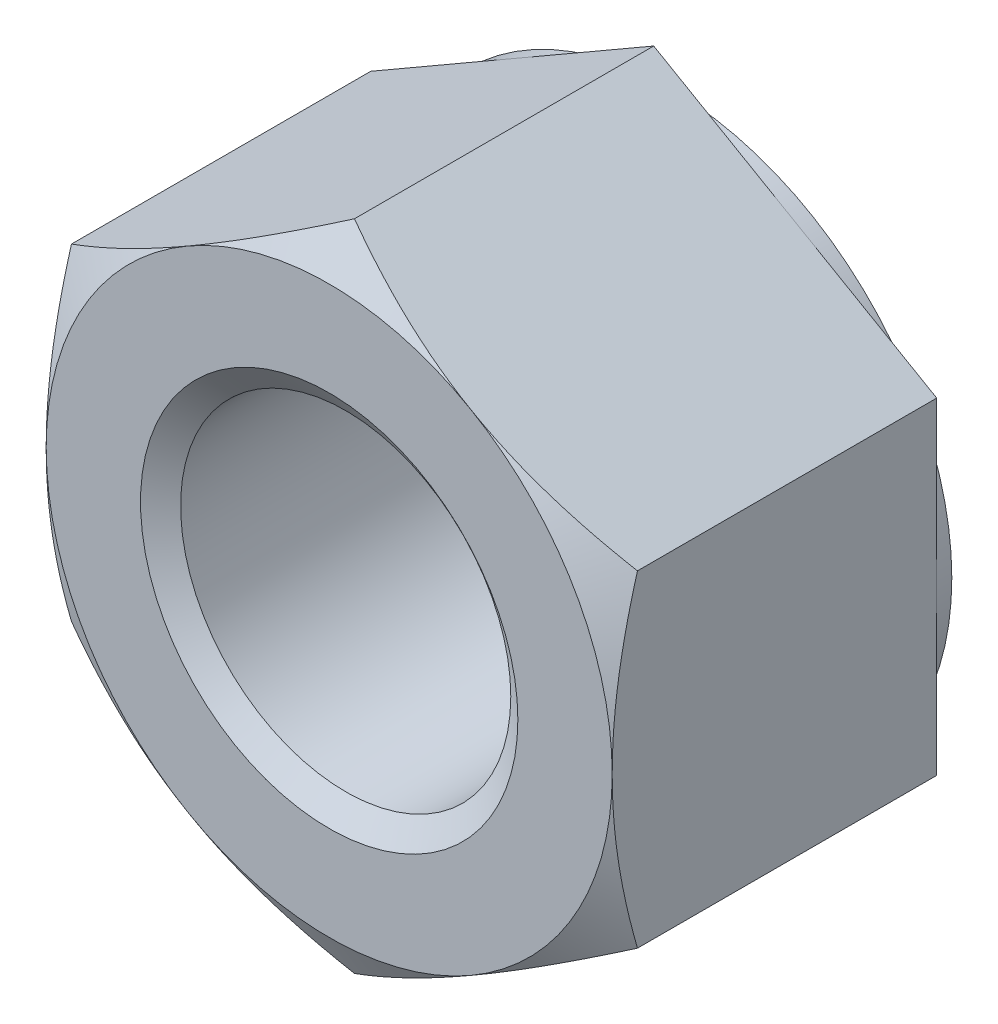
ISO-10303-21;
HEADER;
FILE_DESCRIPTION(('STEP AP214'),'2;1');
FILE_NAME('part.step','',(''),(''),'','','');
FILE_SCHEMA(('AUTOMOTIVE_DESIGN { 1 0 10303 214 1 1 1 1 }'));
ENDSEC;
DATA;
#1=APPLICATION_CONTEXT('core data for automotive mechanical design processes');
#2=APPLICATION_PROTOCOL_DEFINITION('international standard','automotive_design',2000,#1);
#3=PRODUCT_CONTEXT('',#1,'mechanical');
#4=PRODUCT('Part','Part','',(#3));
#5=PRODUCT_RELATED_PRODUCT_CATEGORY('part','',(#4));
#6=PRODUCT_DEFINITION_FORMATION('','',#4);
#7=PRODUCT_DEFINITION_CONTEXT('part definition',#1,'design');
#8=PRODUCT_DEFINITION('design','',#6,#7);
#9=PRODUCT_DEFINITION_SHAPE('','',#8);
#10=(LENGTH_UNIT() NAMED_UNIT(*) SI_UNIT(.MILLI.,.METRE.));
#11=(NAMED_UNIT(*) PLANE_ANGLE_UNIT() SI_UNIT($,.RADIAN.));
#12=(NAMED_UNIT(*) SI_UNIT($,.STERADIAN.) SOLID_ANGLE_UNIT());
#13=UNCERTAINTY_MEASURE_WITH_UNIT(LENGTH_MEASURE(1.E-05),#10,'distance_accuracy_value','');
#14=(GEOMETRIC_REPRESENTATION_CONTEXT(3) GLOBAL_UNCERTAINTY_ASSIGNED_CONTEXT((#13)) GLOBAL_UNIT_ASSIGNED_CONTEXT((#10,
#11,#12)) REPRESENTATION_CONTEXT('',''));
#15=CARTESIAN_POINT('',(0.,0.,0.));
#16=DIRECTION('',(0.,0.,1.));
#17=DIRECTION('',(1.,0.,0.));
#18=AXIS2_PLACEMENT_3D('',#15,#16,#17);
#19=CARTESIAN_POINT('',(0.,0.,-18.));
#20=DIRECTION('',(0.,0.,1.));
#21=DIRECTION('',(1.,0.,0.));
#22=AXIS2_PLACEMENT_3D('',#19,#20,#21);
#23=CYLINDRICAL_SURFACE('',#22,8.75);
#24=CARTESIAN_POINT('',(0.,0.,-0.875259422762141));
#25=DIRECTION('',(0.,0.,1.));
#26=DIRECTION('',(1.,0.,0.));
#27=AXIS2_PLACEMENT_3D('',#24,#25,#26);
#28=CIRCLE('',#27,8.75);
#29=CARTESIAN_POINT('',(8.75,0.,-0.875259422762141));
#30=VERTEX_POINT('',#29);
#31=EDGE_CURVE('E152',#30,#30,#28,.F.);
#32=ORIENTED_EDGE('',*,*,#31,.F.);
#33=EDGE_LOOP('',(#32));
#34=FACE_BOUND('',#33,.T.);
#35=CARTESIAN_POINT('',(0.,0.,-17.0993405772379));
#36=DIRECTION('',(0.,0.,-1.));
#37=DIRECTION('',(-1.,0.,0.));
#38=AXIS2_PLACEMENT_3D('',#35,#36,#37);
#39=CIRCLE('',#38,8.75);
#40=CARTESIAN_POINT('',(-8.75,0.,-17.0993405772379));
#41=VERTEX_POINT('',#40);
#42=EDGE_CURVE('E40',#41,#41,#39,.F.);
#43=ORIENTED_EDGE('',*,*,#42,.F.);
#44=EDGE_LOOP('',(#43));
#45=FACE_BOUND('',#44,.T.);
#46=ADVANCED_FACE('F35',(#34,#45),#23,.F.);
#47=CARTESIAN_POINT('',(-30.,0.,-18.));
#48=DIRECTION('',(0.,0.,1.));
#49=DIRECTION('',(1.,0.,0.));
#50=AXIS2_PLACEMENT_3D('',#47,#48,#49);
#51=PLANE('',#50);
#52=CARTESIAN_POINT('',(0.,0.,-18.));
#53=DIRECTION('',(0.,0.,1.));
#54=DIRECTION('',(1.,0.,0.));
#55=AXIS2_PLACEMENT_3D('',#52,#53,#54);
#56=CIRCLE('',#55,15.);
#57=CARTESIAN_POINT('',(15.,0.,-18.));
#58=VERTEX_POINT('',#57);
#59=EDGE_CURVE('E276',#58,#58,#56,.F.);
#60=ORIENTED_EDGE('',*,*,#59,.T.);
#61=EDGE_LOOP('',(#60));
#62=FACE_BOUND('',#61,.T.);
#63=CARTESIAN_POINT('',(0.,0.,-18.));
#64=DIRECTION('',(0.,0.,1.));
#65=DIRECTION('',(1.,0.,0.));
#66=AXIS2_PLACEMENT_3D('',#63,#64,#65);
#67=CIRCLE('',#66,10.);
#68=CARTESIAN_POINT('',(10.,0.,-18.));
#69=VERTEX_POINT('',#68);
#70=EDGE_CURVE('E296',#69,#69,#67,.F.);
#71=ORIENTED_EDGE('',*,*,#70,.F.);
#72=EDGE_LOOP('',(#71));
#73=FACE_BOUND('',#72,.T.);
#74=ADVANCED_FACE('F228',(#62,#73),#51,.F.);
#75=CARTESIAN_POINT('',(-30.,0.,0.));
#76=DIRECTION('',(0.,0.,1.));
#77=DIRECTION('',(1.,0.,0.));
#78=AXIS2_PLACEMENT_3D('',#75,#76,#77);
#79=PLANE('',#78);
#80=CARTESIAN_POINT('',(0.,0.,0.));
#81=DIRECTION('',(0.,0.,1.));
#82=DIRECTION('',(1.,0.,0.));
#83=AXIS2_PLACEMENT_3D('',#80,#81,#82);
#84=CIRCLE('',#83,15.);
#85=CARTESIAN_POINT('',(15.,0.,0.));
#86=VERTEX_POINT('',#85);
#87=CARTESIAN_POINT('',(7.50000000000002,-12.9903810567666,0.));
#88=VERTEX_POINT('',#87);
#89=EDGE_CURVE('E12',#86,#88,#84,.F.);
#90=ORIENTED_EDGE('',*,*,#89,.F.);
#91=CARTESIAN_POINT('',(0.,0.,0.));
#92=DIRECTION('',(0.,0.,1.));
#93=DIRECTION('',(1.,0.,0.));
#94=AXIS2_PLACEMENT_3D('',#91,#92,#93);
#95=CIRCLE('',#94,15.);
#96=CARTESIAN_POINT('',(7.50000000000002,12.9903810567666,0.));
#97=VERTEX_POINT('',#96);
#98=EDGE_CURVE('E144',#86,#97,#95,.T.);
#99=ORIENTED_EDGE('',*,*,#98,.T.);
#100=CARTESIAN_POINT('',(-7.50000000000002,12.9903810567666,0.));
#101=VERTEX_POINT('',#100);
#102=EDGE_CURVE('E47',#101,#97,#84,.F.);
#103=ORIENTED_EDGE('',*,*,#102,.F.);
#104=CARTESIAN_POINT('',(-15.,0.,0.));
#105=VERTEX_POINT('',#104);
#106=EDGE_CURVE('E357',#105,#101,#84,.F.);
#107=ORIENTED_EDGE('',*,*,#106,.F.);
#108=CARTESIAN_POINT('',(-7.50000000000002,-12.9903810567666,0.));
#109=VERTEX_POINT('',#108);
#110=EDGE_CURVE('E359',#109,#105,#84,.F.);
#111=ORIENTED_EDGE('',*,*,#110,.F.);
#112=EDGE_CURVE('E45',#88,#109,#84,.F.);
#113=ORIENTED_EDGE('',*,*,#112,.F.);
#114=EDGE_LOOP('',(#90,#99,#103,#107,#111,#113));
#115=FACE_BOUND('',#114,.T.);
#116=CARTESIAN_POINT('',(0.,0.,0.));
#117=DIRECTION('',(0.,0.,1.));
#118=DIRECTION('',(1.,0.,0.));
#119=AXIS2_PLACEMENT_3D('',#116,#117,#118);
#120=CIRCLE('',#119,10.);
#121=CARTESIAN_POINT('',(10.,0.,0.));
#122=VERTEX_POINT('',#121);
#123=EDGE_CURVE('E295',#122,#122,#120,.T.);
#124=ORIENTED_EDGE('',*,*,#123,.F.);
#125=EDGE_LOOP('',(#124));
#126=FACE_BOUND('',#125,.T.);
#127=ADVANCED_FACE('F154',(#115,#126),#79,.T.);
#128=CARTESIAN_POINT('',(0.,17.3205080756888,-18.));
#129=DIRECTION('',(-0.500000000000001,0.866025403784438,0.));
#130=DIRECTION('',(-0.866025403784438,-0.500000000000001,0.));
#131=AXIS2_PLACEMENT_3D('',#128,#129,#130);
#132=PLANE('',#131);
#133=DIRECTION('',(0.,0.,1.));
#134=VECTOR('',#133,1.);
#135=CARTESIAN_POINT('',(-15.,8.66025403784437,-18.));
#136=LINE('',#135,#134);
#137=CARTESIAN_POINT('',(-15.,8.66025403784437,-17.2));
#138=VERTEX_POINT('',#137);
#139=CARTESIAN_POINT('',(-15.,8.66025403784437,-1.33974596215562));
#140=VERTEX_POINT('',#139);
#141=EDGE_CURVE('E285',#138,#140,#136,.T.);
#142=ORIENTED_EDGE('',*,*,#141,.T.);
#143=CARTESIAN_POINT('',(-15.0002,8.66013856779054,-1.33981262948894));
#144=CARTESIAN_POINT('',(-14.6705058957662,8.85048754762015,-1.22992178974394));
#145=CARTESIAN_POINT('',(-14.3395258073717,9.04157899075113,-1.12501758932861));
#146=CARTESIAN_POINT('',(-13.674911559644,9.42529420558398,-0.926568581943102));
#147=CARTESIAN_POINT('',(-13.3412765656162,9.61791845919701,-0.833027511049492));
#148=CARTESIAN_POINT('',(-12.6707077197453,10.0050715628708,-0.658562147609859));
#149=CARTESIAN_POINT('',(-12.333767999973,10.199603800782,-0.577667706602186));
#150=CARTESIAN_POINT('',(-11.6575472373606,10.5900200401078,-0.430232643422043));
#151=CARTESIAN_POINT('',(-11.3182663292305,10.7859039637477,-0.363691202381326));
#152=CARTESIAN_POINT('',(-10.6460568576327,11.1740042831265,-0.247792374696308));
#153=CARTESIAN_POINT('',(-10.3131781995737,11.3661918659643,-0.198051383436665));
#154=CARTESIAN_POINT('',(-9.64589556983831,11.7514476718676,-0.114646749003606));
#155=CARTESIAN_POINT('',(-9.31149156892751,11.9445159118115,-0.0809834152900859));
#156=CARTESIAN_POINT('',(-8.64212181582285,12.3309767189539,-0.0305840757080833));
#157=CARTESIAN_POINT('',(-8.30715720719665,12.5243686259132,-0.0138279549580483));
#158=CARTESIAN_POINT('',(-7.636918786609,12.9113309584608,0.00239660617302434));
#159=CARTESIAN_POINT('',(-7.30164498452176,13.1049013783481,0.0018655807275811));
#160=CARTESIAN_POINT('',(-6.6748531126878,13.4667798342773,-0.0152766129981669));
#161=CARTESIAN_POINT('',(-6.38329037496757,13.6351136593857,-0.0297968460490132));
#162=CARTESIAN_POINT('',(-5.80083556199352,13.9713941024471,-0.0716371404224109));
#163=CARTESIAN_POINT('',(-5.50994353564011,14.1393406921673,-0.0989581071094768));
#164=CARTESIAN_POINT('',(-4.92898814775338,14.4747554417509,-0.165923511998906));
#165=CARTESIAN_POINT('',(-4.63892567103482,14.6422230907662,-0.205578128270663));
#166=CARTESIAN_POINT('',(-4.06016058267397,14.9763732703289,-0.296515103017905));
#167=CARTESIAN_POINT('',(-3.77145806484047,15.1430557467157,-0.347798251969261));
#168=CARTESIAN_POINT('',(-2.89508556123959,15.6490296475801,-0.520386864747112));
#169=CARTESIAN_POINT('',(-2.30995340076274,15.9868558579429,-0.658901178256936));
#170=CARTESIAN_POINT('',(-1.14841408999664,16.6574708916881,-0.973271968475219));
#171=CARTESIAN_POINT('',(-0.571992068234585,16.9902683011192,-1.14905461461788));
#172=CARTESIAN_POINT('',(0.000200000000000169,17.3206235457426,-1.33981262948895));
#173=B_SPLINE_CURVE_WITH_KNOTS('',3,(#143,#144,#145,#146,#147,#148,#149,#150,#151,#152,#153,
#154,#155,#156,#157,#158,#159,#160,#161,#162,#163,#164,#165,#166,#167,#168,#169,#170,#171,#172),
.UNSPECIFIED.,.F.,.F.,(4,2,2,2,2,2,2,2,2,2,2,2,2,2,4),(0.,1.18875411504163,2.37789802800057,
3.56980778300395,4.76164951910136,5.92407379683758,7.08652044780812,8.24758247406078,
9.40860862348377,10.4193068498566,11.4300765712312,12.4416826308653,13.4533574773408,
15.5211962051185,17.5849760846241),.UNSPECIFIED.);
#174=EDGE_CURVE('E138',#140,#101,#173,.T.);
#175=ORIENTED_EDGE('',*,*,#174,.T.);
#176=CARTESIAN_POINT('',(0.,17.3205080756888,-1.33974596215562));
#177=VERTEX_POINT('',#176);
#178=EDGE_CURVE('E166',#101,#177,#173,.T.);
#179=ORIENTED_EDGE('',*,*,#178,.T.);
#180=DIRECTION('',(0.,0.,1.));
#181=VECTOR('',#180,1.);
#182=CARTESIAN_POINT('',(0.,17.3205080756888,-18.));
#183=LINE('',#182,#181);
#184=CARTESIAN_POINT('',(0.,17.3205080756888,-17.2));
#185=VERTEX_POINT('',#184);
#186=EDGE_CURVE('E273',#185,#177,#183,.T.);
#187=ORIENTED_EDGE('',*,*,#186,.F.);
#188=DIRECTION('',(-0.866025403784438,-0.500000000000001,0.));
#189=VECTOR('',#188,1.);
#190=CARTESIAN_POINT('',(0.,17.3205080756888,-17.2));
#191=LINE('',#190,#189);
#192=CARTESIAN_POINT('',(-7.50000000000002,12.9903810567666,-17.2));
#193=VERTEX_POINT('',#192);
#194=EDGE_CURVE('E261',#185,#193,#191,.T.);
#195=ORIENTED_EDGE('',*,*,#194,.T.);
#196=EDGE_CURVE('E257',#193,#138,#191,.T.);
#197=ORIENTED_EDGE('',*,*,#196,.T.);
#198=EDGE_LOOP('',(#142,#175,#179,#187,#195,#197));
#199=FACE_BOUND('',#198,.T.);
#200=ADVANCED_FACE('F37',(#199),#132,.T.);
#201=CARTESIAN_POINT('',(15.,8.66025403784437,-18.));
#202=DIRECTION('',(0.500000000000001,0.866025403784438,0.));
#203=DIRECTION('',(-0.866025403784438,0.500000000000001,0.));
#204=AXIS2_PLACEMENT_3D('',#201,#202,#203);
#205=PLANE('',#204);
#206=ORIENTED_EDGE('',*,*,#186,.T.);
#207=CARTESIAN_POINT('',(-0.000200000000000716,17.3206235457426,-1.33981262948895));
#208=CARTESIAN_POINT('',(0.329494104233799,17.130274565913,-1.22992178974395));
#209=CARTESIAN_POINT('',(0.660474192628299,16.939183122782,-1.12501758932862));
#210=CARTESIAN_POINT('',(1.32508844035602,16.5554679079492,-0.926568581943109));
#211=CARTESIAN_POINT('',(1.6587234343838,16.3628436543362,-0.833027511049498));
#212=CARTESIAN_POINT('',(2.32929228025473,15.9756905506624,-0.658562147609865));
#213=CARTESIAN_POINT('',(2.66623200002701,15.7811583127512,-0.577667706602193));
#214=CARTESIAN_POINT('',(3.34245276263938,15.3907420734253,-0.430232643422049));
#215=CARTESIAN_POINT('',(3.68173367076951,15.1948581497855,-0.36369120238133));
#216=CARTESIAN_POINT('',(4.35394314236732,14.8067578304067,-0.247792374696311));
#217=CARTESIAN_POINT('',(4.68682180042634,14.6145702475688,-0.198051383436668));
#218=CARTESIAN_POINT('',(5.3541044301617,14.2293144416656,-0.114646749003608));
#219=CARTESIAN_POINT('',(5.68850843107249,14.0362462017216,-0.0809834152900865));
#220=CARTESIAN_POINT('',(6.35787818417715,13.6497853945792,-0.0305840757080828));
#221=CARTESIAN_POINT('',(6.69284279280335,13.4563934876199,-0.0138279549580478));
#222=CARTESIAN_POINT('',(7.36308121339101,13.0694311550724,0.00239660617302488));
#223=CARTESIAN_POINT('',(7.69835501547825,12.8758607351851,0.00186558072758167));
#224=CARTESIAN_POINT('',(8.32514688731221,12.5139822792559,-0.015276612998165));
#225=CARTESIAN_POINT('',(8.61670962503243,12.3456484541475,-0.0297968460490101));
#226=CARTESIAN_POINT('',(9.19916443800648,12.0093680110861,-0.0716371404224066));
#227=CARTESIAN_POINT('',(9.49005646435989,11.8414214213658,-0.0989581071094725));
#228=CARTESIAN_POINT('',(10.0710118522466,11.5060066717823,-0.165923511998902));
#229=CARTESIAN_POINT('',(10.3610743289652,11.338539022767,-0.205578128270659));
#230=CARTESIAN_POINT('',(10.939839417326,11.0043888432043,-0.296515103017901));
#231=CARTESIAN_POINT('',(11.2285419351595,10.8377063668174,-0.347798251969255));
#232=CARTESIAN_POINT('',(12.1049144387604,10.3317324659531,-0.520386864747105));
#233=CARTESIAN_POINT('',(12.6900465992373,9.99390625559024,-0.658901178256929));
#234=CARTESIAN_POINT('',(13.8515859100034,9.32329122184509,-0.973271968475214));
#235=CARTESIAN_POINT('',(14.4280079317654,8.99049381241394,-1.14905461461788));
#236=CARTESIAN_POINT('',(15.0002,8.66013856779053,-1.33981262948894));
#237=B_SPLINE_CURVE_WITH_KNOTS('',3,(#207,#208,#209,#210,#211,#212,#213,#214,#215,#216,#217,
#218,#219,#220,#221,#222,#223,#224,#225,#226,#227,#228,#229,#230,#231,#232,#233,#234,#235,#236),
.UNSPECIFIED.,.F.,.F.,(4,2,2,2,2,2,2,2,2,2,2,2,2,2,4),(0.,1.18875411504163,2.37789802800057,
3.56980778300395,4.76164951910136,5.92407379683759,7.08652044780812,8.24758247406079,
9.40860862348377,10.4193068498566,11.4300765712312,12.4416826308653,13.4533574773408,
15.5211962051185,17.5849760846241),.UNSPECIFIED.);
#238=EDGE_CURVE('E162',#177,#97,#237,.T.);
#239=ORIENTED_EDGE('',*,*,#238,.T.);
#240=CARTESIAN_POINT('',(15.,8.66025403784441,-1.33974596215562));
#241=VERTEX_POINT('',#240);
#242=EDGE_CURVE('E147',#97,#241,#237,.T.);
#243=ORIENTED_EDGE('',*,*,#242,.T.);
#244=DIRECTION('',(0.,0.,1.));
#245=VECTOR('',#244,1.);
#246=CARTESIAN_POINT('',(15.,8.66025403784437,-18.));
#247=LINE('',#246,#245);
#248=CARTESIAN_POINT('',(15.,8.66025403784437,-17.2));
#249=VERTEX_POINT('',#248);
#250=EDGE_CURVE('E161',#249,#241,#247,.T.);
#251=ORIENTED_EDGE('',*,*,#250,.F.);
#252=DIRECTION('',(-0.866025403784438,0.500000000000001,0.));
#253=VECTOR('',#252,1.);
#254=CARTESIAN_POINT('',(15.,8.66025403784437,-17.2));
#255=LINE('',#254,#253);
#256=CARTESIAN_POINT('',(7.50000000000001,12.9903810567666,-17.2));
#257=VERTEX_POINT('',#256);
#258=EDGE_CURVE('E269',#249,#257,#255,.T.);
#259=ORIENTED_EDGE('',*,*,#258,.T.);
#260=EDGE_CURVE('E265',#257,#185,#255,.T.);
#261=ORIENTED_EDGE('',*,*,#260,.T.);
#262=EDGE_LOOP('',(#206,#239,#243,#251,#259,#261));
#263=FACE_BOUND('',#262,.T.);
#264=ADVANCED_FACE('F241',(#263),#205,.T.);
#265=CARTESIAN_POINT('',(15.,8.66025403784437,-18.));
#266=DIRECTION('',(-1.,0.,0.));
#267=DIRECTION('',(0.,0.,1.));
#268=AXIS2_PLACEMENT_3D('',#265,#266,#267);
#269=PLANE('',#268);
#270=CARTESIAN_POINT('',(15.,-22.9682699623457,-7.17790057965227));
#271=CARTESIAN_POINT('',(15.,-22.6389897831074,-7.01873142404233));
#272=CARTESIAN_POINT('',(15.,-22.3093116021534,-6.86038603901538));
#273=CARTESIAN_POINT('',(15.,-21.6490751536497,-6.54553189598666));
#274=CARTESIAN_POINT('',(15.,-21.3185168764807,-6.38902315816101));
#275=CARTESIAN_POINT('',(15.,-20.3252989549744,-5.92249019185913));
#276=CARTESIAN_POINT('',(15.,-19.6612032697286,-5.61551110607191));
#277=CARTESIAN_POINT('',(15.,-18.3246226043912,-5.00989859467258));
#278=CARTESIAN_POINT('',(15.,-17.6521113636296,-4.71132298088698));
#279=CARTESIAN_POINT('',(15.,-16.3015621477647,-4.12699119584707));
#280=CARTESIAN_POINT('',(15.,-15.6235244629268,-3.84123435637443));
#281=CARTESIAN_POINT('',(15.,-14.2524269634776,-3.28256457383085));
#282=CARTESIAN_POINT('',(15.,-13.5592849190571,-3.00985238384249));
#283=CARTESIAN_POINT('',(15.,-12.1648203164479,-2.48578579805704));
#284=CARTESIAN_POINT('',(15.,-11.4634968579634,-2.23443377846729));
#285=CARTESIAN_POINT('',(15.,-10.0530172161698,-1.75984469264095));
#286=CARTESIAN_POINT('',(15.,-9.34388131081086,-1.53654785403614));
#287=CARTESIAN_POINT('',(15.,-7.91545988349901,-1.12531011422904));
#288=CARTESIAN_POINT('',(15.,-7.19617764885278,-0.937358032225481));
#289=CARTESIAN_POINT('',(15.,-6.10950776052104,-0.68881881982808));
#290=CARTESIAN_POINT('',(15.,-5.74591626101914,-0.611524520059371));
#291=CARTESIAN_POINT('',(15.,-5.01631310495844,-0.469286024803709));
#292=CARTESIAN_POINT('',(15.,-4.65030150125062,-0.404341560532858));
#293=CARTESIAN_POINT('',(15.,-3.91609659669047,-0.287952997760446));
#294=CARTESIAN_POINT('',(15.,-3.54790312013281,-0.236510002059407));
#295=CARTESIAN_POINT('',(15.,-2.80977894214556,-0.148161213469115));
#296=CARTESIAN_POINT('',(15.,-2.43984831081849,-0.111254838973176));
#297=CARTESIAN_POINT('',(15.,-1.70111543119015,-0.0529692351511495));
#298=CARTESIAN_POINT('',(15.,-1.3323208752846,-0.0314931455080655));
#299=CARTESIAN_POINT('',(15.,-0.594154033471582,-0.00418216853329556));
#300=CARTESIAN_POINT('',(15.,-0.224781755128986,0.00165292191908621));
#301=CARTESIAN_POINT('',(15.,0.513772761739784,-0.00245653426590893));
#302=CARTESIAN_POINT('',(15.,0.882955024506784,-0.0123966523921697));
#303=CARTESIAN_POINT('',(15.,1.62057875039961,-0.0478095011464145));
#304=CARTESIAN_POINT('',(15.,1.98902017560892,-0.0732830074530984));
#305=CARTESIAN_POINT('',(15.,2.8820087859798,-0.153315988744048));
#306=CARTESIAN_POINT('',(15.,3.40586988037196,-0.215658229469292));
#307=CARTESIAN_POINT('',(15.,4.44957771463113,-0.368284321561815));
#308=CARTESIAN_POINT('',(15.,4.96942331940065,-0.458575797224096));
#309=CARTESIAN_POINT('',(15.,6.00467140043031,-0.663898119259711));
#310=CARTESIAN_POINT('',(15.,6.52006919294574,-0.778952357645808));
#311=CARTESIAN_POINT('',(15.,7.54556200724785,-1.030289356594));
#312=CARTESIAN_POINT('',(15.,8.0556575236537,-1.1665701177488));
#313=CARTESIAN_POINT('',(15.,9.08310964327574,-1.46066370490327));
#314=CARTESIAN_POINT('',(15.,9.60033774272843,-1.61892244443969));
#315=CARTESIAN_POINT('',(15.,10.6293258234342,-1.95107200986663));
#316=CARTESIAN_POINT('',(15.,11.1410893076101,-2.12495205365791));
#317=CARTESIAN_POINT('',(15.,12.1570993841288,-2.48477464183465));
#318=CARTESIAN_POINT('',(15.,12.6613720729254,-2.67064378150476));
#319=CARTESIAN_POINT('',(15.,13.4147912594165,-2.95756327132974));
#320=CARTESIAN_POINT('',(15.,13.6654863245841,-3.05457748949892));
#321=CARTESIAN_POINT('',(15.,14.1659013187592,-3.2510732293356));
#322=CARTESIAN_POINT('',(15.,14.4156212703266,-3.35055469352571));
#323=CARTESIAN_POINT('',(15.,14.6648887120004,-3.45115877453161));
#324=B_SPLINE_CURVE_WITH_KNOTS('',3,(#270,#271,#272,#273,#274,#275,#276,#277,#278,#279,#280,
#281,#282,#283,#284,#285,#286,#287,#288,#289,#290,#291,#292,#293,#294,#295,#296,#297,#298,#299,
#300,#301,#302,#303,#304,#305,#306,#307,#308,#309,#310,#311,#312,#313,#314,#315,#316,#317,#318,
#319,#320,#321,#322,#323),.UNSPECIFIED.,.F.,.F.,(4,2,2,2,2,2,2,2,2,2,2,2,2,2,2,2,2,2,2,2,2,2,2,
2,2,2,4),(0.,1.09719534304745,2.19440272785255,4.38917437060373,6.59650580508102,
8.80372204153741,11.0380360432621,13.2725982762572,15.502315932016,17.7313270580364,
18.8463006788364,19.9612500303848,21.0762904227212,22.1912861980293,23.2992201789375,
24.4071397716721,25.5147483975893,26.6224123378252,28.2042036031028,29.7864267473646,
31.3701511423085,32.9537264503146,34.5761185954281,36.1973994161361,37.8095545791833,
38.615979427752,39.4223855073193),.UNSPECIFIED.);
#325=CARTESIAN_POINT('',(15.,-8.66025403784442,-1.33974596215562));
#326=VERTEX_POINT('',#325);
#327=EDGE_CURVE('E127',#326,#86,#324,.T.);
#328=ORIENTED_EDGE('',*,*,#327,.F.);
#329=DIRECTION('',(0.,0.,1.));
#330=VECTOR('',#329,1.);
#331=CARTESIAN_POINT('',(15.,-8.66025403784441,-18.));
#332=LINE('',#331,#330);
#333=CARTESIAN_POINT('',(15.,-8.66025403784441,-17.2));
#334=VERTEX_POINT('',#333);
#335=EDGE_CURVE('E278',#334,#326,#332,.T.);
#336=ORIENTED_EDGE('',*,*,#335,.F.);
#337=DIRECTION('',(0.,-1.,0.));
#338=VECTOR('',#337,1.);
#339=CARTESIAN_POINT('',(15.,8.66025403784437,-17.2));
#340=LINE('',#339,#338);
#341=CARTESIAN_POINT('',(15.,0.,-17.2));
#342=VERTEX_POINT('',#341);
#343=EDGE_CURVE('E270',#342,#334,#340,.T.);
#344=ORIENTED_EDGE('',*,*,#343,.F.);
#345=EDGE_CURVE('E272',#249,#342,#340,.T.);
#346=ORIENTED_EDGE('',*,*,#345,.F.);
#347=ORIENTED_EDGE('',*,*,#250,.T.);
#348=EDGE_CURVE('E140',#86,#241,#324,.T.);
#349=ORIENTED_EDGE('',*,*,#348,.F.);
#350=EDGE_LOOP('',(#328,#336,#344,#346,#347,#349));
#351=FACE_BOUND('',#350,.T.);
#352=ADVANCED_FACE('F158',(#351),#269,.F.);
#353=CARTESIAN_POINT('',(0.,-17.3205080756888,-18.));
#354=DIRECTION('',(0.500000000000001,-0.866025403784438,0.));
#355=DIRECTION('',(0.866025403784438,0.500000000000001,0.));
#356=AXIS2_PLACEMENT_3D('',#353,#354,#355);
#357=PLANE('',#356);
#358=ORIENTED_EDGE('',*,*,#335,.T.);
#359=CARTESIAN_POINT('',(15.0002,-8.66013856779057,-1.33981262948895));
#360=CARTESIAN_POINT('',(14.6705058957662,-8.85048754762019,-1.22992178974395));
#361=CARTESIAN_POINT('',(14.3395258073717,-9.04157899075116,-1.12501758932862));
#362=CARTESIAN_POINT('',(13.674911559644,-9.42529420558402,-0.926568581943113));
#363=CARTESIAN_POINT('',(13.3412765656162,-9.61791845919704,-0.833027511049504));
#364=CARTESIAN_POINT('',(12.6707077197453,-10.0050715628708,-0.658562147609871));
#365=CARTESIAN_POINT('',(12.333767999973,-10.199603800782,-0.577667706602198));
#366=CARTESIAN_POINT('',(11.6575472373606,-10.5900200401079,-0.430232643422054));
#367=CARTESIAN_POINT('',(11.3182663292305,-10.7859039637477,-0.363691202381338));
#368=CARTESIAN_POINT('',(10.6460568576327,-11.1740042831265,-0.247792374696322));
#369=CARTESIAN_POINT('',(10.3131781995737,-11.3661918659644,-0.198051383436679));
#370=CARTESIAN_POINT('',(9.6458955698383,-11.7514476718676,-0.114646749003621));
#371=CARTESIAN_POINT('',(9.3114915689275,-11.9445159118116,-0.080983415290101));
#372=CARTESIAN_POINT('',(8.64212181582284,-12.330976718954,-0.0305840757080993));
#373=CARTESIAN_POINT('',(8.30715720719664,-12.5243686259133,-0.0138279549580646));
#374=CARTESIAN_POINT('',(7.63691878660899,-12.9113309584608,0.00239660617300668));
#375=CARTESIAN_POINT('',(7.30164498452175,-13.1049013783481,0.00186558072756239));
#376=CARTESIAN_POINT('',(6.67485311268779,-13.4667798342773,-0.0152766129981866));
#377=CARTESIAN_POINT('',(6.38329037496757,-13.6351136593857,-0.029796846049033));
#378=CARTESIAN_POINT('',(5.80083556199351,-13.9713941024471,-0.0716371404224307));
#379=CARTESIAN_POINT('',(5.5099435356401,-14.1393406921674,-0.0989581071094967));
#380=CARTESIAN_POINT('',(4.92898814775337,-14.4747554417509,-0.165923511998927));
#381=CARTESIAN_POINT('',(4.63892567103481,-14.6422230907662,-0.205578128270684));
#382=CARTESIAN_POINT('',(4.06016058267396,-14.9763732703289,-0.296515103017927));
#383=CARTESIAN_POINT('',(3.77145806484046,-15.1430557467158,-0.347798251969283));
#384=CARTESIAN_POINT('',(2.89508556123959,-15.6490296475801,-0.520386864747134));
#385=CARTESIAN_POINT('',(2.30995340076274,-15.986855857943,-0.658901178256957));
#386=CARTESIAN_POINT('',(1.14841408999663,-16.6574708916881,-0.973271968475242));
#387=CARTESIAN_POINT('',(0.571992068234582,-16.9902683011193,-1.14905461461791));
#388=CARTESIAN_POINT('',(-0.000200000000001088,-17.3206235457427,-1.33981262948897));
#389=B_SPLINE_CURVE_WITH_KNOTS('',3,(#359,#360,#361,#362,#363,#364,#365,#366,#367,#368,#369,
#370,#371,#372,#373,#374,#375,#376,#377,#378,#379,#380,#381,#382,#383,#384,#385,#386,#387,#388),
.UNSPECIFIED.,.F.,.F.,(4,2,2,2,2,2,2,2,2,2,2,2,2,2,4),(0.,1.18875411504163,2.37789802800057,
3.56980778300395,4.76164951910137,5.92407379683759,7.08652044780813,8.24758247406079,
9.40860862348378,10.4193068498566,11.4300765712312,12.4416826308653,13.4533574773408,
15.5211962051185,17.5849760846241),.UNSPECIFIED.);
#390=EDGE_CURVE('E133',#326,#88,#389,.T.);
#391=ORIENTED_EDGE('',*,*,#390,.T.);
#392=CARTESIAN_POINT('',(0.,-17.3205080756888,-1.33974596215562));
#393=VERTEX_POINT('',#392);
#394=EDGE_CURVE('E54',#88,#393,#389,.T.);
#395=ORIENTED_EDGE('',*,*,#394,.T.);
#396=DIRECTION('',(0.,0.,1.));
#397=VECTOR('',#396,1.);
#398=CARTESIAN_POINT('',(0.,-17.3205080756888,-18.));
#399=LINE('',#398,#397);
#400=CARTESIAN_POINT('',(0.,-17.3205080756888,-17.2));
#401=VERTEX_POINT('',#400);
#402=EDGE_CURVE('E280',#401,#393,#399,.T.);
#403=ORIENTED_EDGE('',*,*,#402,.F.);
#404=DIRECTION('',(0.866025403784438,0.500000000000001,0.));
#405=VECTOR('',#404,1.);
#406=CARTESIAN_POINT('',(0.,-17.3205080756888,-17.2));
#407=LINE('',#406,#405);
#408=CARTESIAN_POINT('',(7.50000000000004,-12.9903810567666,-17.2));
#409=VERTEX_POINT('',#408);
#410=EDGE_CURVE('E262',#401,#409,#407,.T.);
#411=ORIENTED_EDGE('',*,*,#410,.T.);
#412=EDGE_CURVE('E266',#409,#334,#407,.T.);
#413=ORIENTED_EDGE('',*,*,#412,.T.);
#414=EDGE_LOOP('',(#358,#391,#395,#403,#411,#413));
#415=FACE_BOUND('',#414,.T.);
#416=ADVANCED_FACE('F214',(#415),#357,.T.);
#417=CARTESIAN_POINT('',(-15.,-8.66025403784441,-18.));
#418=DIRECTION('',(-0.500000000000001,-0.866025403784438,0.));
#419=DIRECTION('',(0.866025403784438,-0.500000000000001,0.));
#420=AXIS2_PLACEMENT_3D('',#417,#418,#419);
#421=PLANE('',#420);
#422=ORIENTED_EDGE('',*,*,#402,.T.);
#423=CARTESIAN_POINT('',(0.0002,-17.3206235457427,-1.33981262948897));
#424=CARTESIAN_POINT('',(-0.329494104233801,-17.130274565913,-1.22992178974397));
#425=CARTESIAN_POINT('',(-0.660474192628302,-16.9391831227821,-1.12501758932864));
#426=CARTESIAN_POINT('',(-1.32508844035602,-16.5554679079492,-0.926568581943131));
#427=CARTESIAN_POINT('',(-1.65872343438381,-16.3628436543362,-0.833027511049521));
#428=CARTESIAN_POINT('',(-2.32929228025473,-15.9756905506624,-0.658562147609886));
#429=CARTESIAN_POINT('',(-2.66623200002702,-15.7811583127512,-0.577667706602212));
#430=CARTESIAN_POINT('',(-3.34245276263939,-15.3907420734254,-0.430232643422067));
#431=CARTESIAN_POINT('',(-3.68173367076952,-15.1948581497855,-0.36369120238135));
#432=CARTESIAN_POINT('',(-4.35394314236733,-14.8067578304067,-0.247792374696331));
#433=CARTESIAN_POINT('',(-4.68682180042635,-14.6145702475689,-0.198051383436687));
#434=CARTESIAN_POINT('',(-5.35410443016171,-14.2293144416656,-0.114646749003627));
#435=CARTESIAN_POINT('',(-5.68850843107251,-14.0362462017216,-0.080983415290106));
#436=CARTESIAN_POINT('',(-6.35787818417717,-13.6497853945793,-0.0305840757081023));
#437=CARTESIAN_POINT('',(-6.69284279280337,-13.4563934876199,-0.0138279549580668));
#438=CARTESIAN_POINT('',(-7.36308121339103,-13.0694311550724,0.00239660617300584));
#439=CARTESIAN_POINT('',(-7.69835501547827,-12.8758607351851,0.0018655807275622));
#440=CARTESIAN_POINT('',(-8.32514688731223,-12.5139822792559,-0.0152766129981846));
#441=CARTESIAN_POINT('',(-8.61670962503245,-12.3456484541475,-0.0297968460490295));
#442=CARTESIAN_POINT('',(-9.1991644380065,-12.0093680110861,-0.0716371404224256));
#443=CARTESIAN_POINT('',(-9.49005646435991,-11.8414214213659,-0.0989581071094914));
#444=CARTESIAN_POINT('',(-10.0710118522466,-11.5060066717823,-0.16592351199892));
#445=CARTESIAN_POINT('',(-10.3610743289652,-11.338539022767,-0.205578128270677));
#446=CARTESIAN_POINT('',(-10.939839417326,-11.0043888432043,-0.296515103017917));
#447=CARTESIAN_POINT('',(-11.2285419351595,-10.8377063668174,-0.347798251969272));
#448=CARTESIAN_POINT('',(-12.1049144387604,-10.3317324659531,-0.52038686474712));
#449=CARTESIAN_POINT('',(-12.6900465992373,-9.99390625559027,-0.658901178256943));
#450=CARTESIAN_POINT('',(-13.8515859100034,-9.32329122184512,-0.973271968475224));
#451=CARTESIAN_POINT('',(-14.4280079317654,-8.99049381241398,-1.14905461461789));
#452=CARTESIAN_POINT('',(-15.0002,-8.66013856779057,-1.33981262948895));
#453=B_SPLINE_CURVE_WITH_KNOTS('',3,(#423,#424,#425,#426,#427,#428,#429,#430,#431,#432,#433,
#434,#435,#436,#437,#438,#439,#440,#441,#442,#443,#444,#445,#446,#447,#448,#449,#450,#451,#452),
.UNSPECIFIED.,.F.,.F.,(4,2,2,2,2,2,2,2,2,2,2,2,2,2,4),(0.,1.18875411504163,2.37789802800058,
3.56980778300396,4.76164951910137,5.92407379683761,7.08652044780814,8.24758247406081,
9.4086086234838,10.4193068498567,11.4300765712312,12.4416826308653,13.4533574773408,
15.5211962051185,17.5849760846241),.UNSPECIFIED.);
#454=EDGE_CURVE('E208',#393,#109,#453,.T.);
#455=ORIENTED_EDGE('',*,*,#454,.T.);
#456=CARTESIAN_POINT('',(-15.,-8.66025403784441,-1.33974596215562));
#457=VERTEX_POINT('',#456);
#458=EDGE_CURVE('E61',#109,#457,#453,.T.);
#459=ORIENTED_EDGE('',*,*,#458,.T.);
#460=DIRECTION('',(0.,0.,1.));
#461=VECTOR('',#460,1.);
#462=CARTESIAN_POINT('',(-15.,-8.66025403784441,-18.));
#463=LINE('',#462,#461);
#464=CARTESIAN_POINT('',(-15.,-8.66025403784441,-17.2));
#465=VERTEX_POINT('',#464);
#466=EDGE_CURVE('E283',#465,#457,#463,.T.);
#467=ORIENTED_EDGE('',*,*,#466,.F.);
#468=DIRECTION('',(0.866025403784438,-0.500000000000001,0.));
#469=VECTOR('',#468,1.);
#470=CARTESIAN_POINT('',(-15.,-8.66025403784441,-17.2));
#471=LINE('',#470,#469);
#472=CARTESIAN_POINT('',(-7.50000000000004,-12.9903810567666,-17.2));
#473=VERTEX_POINT('',#472);
#474=EDGE_CURVE('E252',#465,#473,#471,.T.);
#475=ORIENTED_EDGE('',*,*,#474,.T.);
#476=EDGE_CURVE('E258',#473,#401,#471,.T.);
#477=ORIENTED_EDGE('',*,*,#476,.T.);
#478=EDGE_LOOP('',(#422,#455,#459,#467,#475,#477));
#479=FACE_BOUND('',#478,.T.);
#480=ADVANCED_FACE('F210',(#479),#421,.T.);
#481=CARTESIAN_POINT('',(-15.,8.66025403784437,-18.));
#482=DIRECTION('',(-1.,0.,0.));
#483=DIRECTION('',(0.,0.,1.));
#484=AXIS2_PLACEMENT_3D('',#481,#482,#483);
#485=PLANE('',#484);
#486=ORIENTED_EDGE('',*,*,#466,.T.);
#487=CARTESIAN_POINT('',(-15.,-22.9682699623457,-7.17790057965227));
#488=CARTESIAN_POINT('',(-15.,-22.6389897831074,-7.01873142404233));
#489=CARTESIAN_POINT('',(-15.,-22.3093116021534,-6.86038603901538));
#490=CARTESIAN_POINT('',(-15.,-21.6490751536497,-6.54553189598666));
#491=CARTESIAN_POINT('',(-15.,-21.3185168764807,-6.38902315816101));
#492=CARTESIAN_POINT('',(-15.,-20.3252989549744,-5.92249019185913));
#493=CARTESIAN_POINT('',(-15.,-19.6612032697286,-5.61551110607191));
#494=CARTESIAN_POINT('',(-15.,-18.3246226043912,-5.00989859467258));
#495=CARTESIAN_POINT('',(-15.,-17.6521113636296,-4.71132298088698));
#496=CARTESIAN_POINT('',(-15.,-16.3015621477647,-4.12699119584707));
#497=CARTESIAN_POINT('',(-15.,-15.6235244629268,-3.84123435637443));
#498=CARTESIAN_POINT('',(-15.,-14.2524269634776,-3.28256457383085));
#499=CARTESIAN_POINT('',(-15.,-13.5592849190571,-3.00985238384249));
#500=CARTESIAN_POINT('',(-15.,-12.1648203164479,-2.48578579805704));
#501=CARTESIAN_POINT('',(-15.,-11.4634968579634,-2.23443377846729));
#502=CARTESIAN_POINT('',(-15.,-10.0530172161698,-1.75984469264095));
#503=CARTESIAN_POINT('',(-15.,-9.34388131081086,-1.53654785403614));
#504=CARTESIAN_POINT('',(-15.,-7.91545988349901,-1.12531011422904));
#505=CARTESIAN_POINT('',(-15.,-7.19617764885278,-0.937358032225481));
#506=CARTESIAN_POINT('',(-15.,-6.10950776052104,-0.68881881982808));
#507=CARTESIAN_POINT('',(-15.,-5.74591626101914,-0.611524520059371));
#508=CARTESIAN_POINT('',(-15.,-5.01631310495844,-0.469286024803709));
#509=CARTESIAN_POINT('',(-15.,-4.65030150125062,-0.404341560532858));
#510=CARTESIAN_POINT('',(-15.,-3.91609659669047,-0.287952997760446));
#511=CARTESIAN_POINT('',(-15.,-3.54790312013281,-0.236510002059407));
#512=CARTESIAN_POINT('',(-15.,-2.80977894214556,-0.148161213469115));
#513=CARTESIAN_POINT('',(-15.,-2.43984831081849,-0.111254838973176));
#514=CARTESIAN_POINT('',(-15.,-1.70111543119015,-0.0529692351511495));
#515=CARTESIAN_POINT('',(-15.,-1.3323208752846,-0.0314931455080655));
#516=CARTESIAN_POINT('',(-15.,-0.594154033471582,-0.00418216853329556));
#517=CARTESIAN_POINT('',(-15.,-0.224781755128986,0.00165292191908621));
#518=CARTESIAN_POINT('',(-15.,0.513772761739784,-0.00245653426590893));
#519=CARTESIAN_POINT('',(-15.,0.882955024506784,-0.0123966523921697));
#520=CARTESIAN_POINT('',(-15.,1.62057875039961,-0.0478095011464145));
#521=CARTESIAN_POINT('',(-15.,1.98902017560892,-0.0732830074530984));
#522=CARTESIAN_POINT('',(-15.,2.8820087859798,-0.153315988744048));
#523=CARTESIAN_POINT('',(-15.,3.40586988037196,-0.215658229469292));
#524=CARTESIAN_POINT('',(-15.,4.44957771463113,-0.368284321561815));
#525=CARTESIAN_POINT('',(-15.,4.96942331940065,-0.458575797224096));
#526=CARTESIAN_POINT('',(-15.,6.00467140043031,-0.663898119259711));
#527=CARTESIAN_POINT('',(-15.,6.52006919294574,-0.778952357645808));
#528=CARTESIAN_POINT('',(-15.,7.54556200724785,-1.030289356594));
#529=CARTESIAN_POINT('',(-15.,8.0556575236537,-1.1665701177488));
#530=CARTESIAN_POINT('',(-15.,9.08310964327574,-1.46066370490327));
#531=CARTESIAN_POINT('',(-15.,9.60033774272843,-1.61892244443969));
#532=CARTESIAN_POINT('',(-15.,10.6293258234342,-1.95107200986663));
#533=CARTESIAN_POINT('',(-15.,11.1410893076101,-2.12495205365791));
#534=CARTESIAN_POINT('',(-15.,12.1570993841288,-2.48477464183465));
#535=CARTESIAN_POINT('',(-15.,12.6613720729254,-2.67064378150476));
#536=CARTESIAN_POINT('',(-15.,13.4147912594165,-2.95756327132974));
#537=CARTESIAN_POINT('',(-15.,13.6654863245841,-3.05457748949892));
#538=CARTESIAN_POINT('',(-15.,14.1659013187592,-3.2510732293356));
#539=CARTESIAN_POINT('',(-15.,14.4156212703266,-3.35055469352571));
#540=CARTESIAN_POINT('',(-15.,14.6648887120004,-3.45115877453161));
#541=B_SPLINE_CURVE_WITH_KNOTS('',3,(#487,#488,#489,#490,#491,#492,#493,#494,#495,#496,#497,
#498,#499,#500,#501,#502,#503,#504,#505,#506,#507,#508,#509,#510,#511,#512,#513,#514,#515,#516,
#517,#518,#519,#520,#521,#522,#523,#524,#525,#526,#527,#528,#529,#530,#531,#532,#533,#534,#535,
#536,#537,#538,#539,#540),.UNSPECIFIED.,.F.,.F.,(4,2,2,2,2,2,2,2,2,2,2,2,2,2,2,2,2,2,2,2,2,2,2,
2,2,2,4),(0.,1.09719534304745,2.19440272785255,4.38917437060373,6.59650580508102,
8.80372204153741,11.0380360432621,13.2725982762572,15.502315932016,17.7313270580364,
18.8463006788364,19.9612500303848,21.0762904227212,22.1912861980293,23.2992201789375,
24.4071397716721,25.5147483975893,26.6224123378252,28.2042036031028,29.7864267473646,
31.3701511423085,32.9537264503146,34.5761185954281,36.1973994161361,37.8095545791833,
38.615979427752,39.4223855073193),.UNSPECIFIED.);
#542=EDGE_CURVE('E209',#457,#105,#541,.T.);
#543=ORIENTED_EDGE('',*,*,#542,.T.);
#544=EDGE_CURVE('E151',#105,#140,#541,.T.);
#545=ORIENTED_EDGE('',*,*,#544,.T.);
#546=ORIENTED_EDGE('',*,*,#141,.F.);
#547=DIRECTION('',(0.,-1.,0.));
#548=VECTOR('',#547,1.);
#549=CARTESIAN_POINT('',(-15.,8.66025403784437,-17.2));
#550=LINE('',#549,#548);
#551=CARTESIAN_POINT('',(-15.,0.,-17.2));
#552=VERTEX_POINT('',#551);
#553=EDGE_CURVE('E292',#138,#552,#550,.T.);
#554=ORIENTED_EDGE('',*,*,#553,.T.);
#555=EDGE_CURVE('E290',#552,#465,#550,.T.);
#556=ORIENTED_EDGE('',*,*,#555,.T.);
#557=EDGE_LOOP('',(#486,#543,#545,#546,#554,#556));
#558=FACE_BOUND('',#557,.T.);
#559=ADVANCED_FACE('F213',(#558),#485,.T.);
#560=CARTESIAN_POINT('',(0.,27.3205080756888,-17.2));
#561=DIRECTION('',(0.,0.,-1.));
#562=DIRECTION('',(-1.,0.,0.));
#563=AXIS2_PLACEMENT_3D('',#560,#561,#562);
#564=PLANE('',#563);
#565=ORIENTED_EDGE('',*,*,#345,.T.);
#566=CARTESIAN_POINT('',(0.,0.,-17.2));
#567=DIRECTION('',(0.,0.,1.));
#568=DIRECTION('',(1.,0.,0.));
#569=AXIS2_PLACEMENT_3D('',#566,#567,#568);
#570=CIRCLE('',#569,15.);
#571=EDGE_CURVE('E249',#342,#257,#570,.T.);
#572=ORIENTED_EDGE('',*,*,#571,.T.);
#573=ORIENTED_EDGE('',*,*,#258,.F.);
#574=EDGE_LOOP('',(#565,#572,#573));
#575=FACE_BOUND('',#574,.T.);
#576=ADVANCED_FACE('F219',(#575),#564,.T.);
#577=ORIENTED_EDGE('',*,*,#343,.T.);
#578=ORIENTED_EDGE('',*,*,#412,.F.);
#579=EDGE_CURVE('E254',#409,#342,#570,.T.);
#580=ORIENTED_EDGE('',*,*,#579,.T.);
#581=EDGE_LOOP('',(#577,#578,#580));
#582=FACE_BOUND('',#581,.T.);
#583=ADVANCED_FACE('F224',(#582),#564,.T.);
#584=EDGE_CURVE('E253',#257,#193,#570,.T.);
#585=ORIENTED_EDGE('',*,*,#584,.T.);
#586=ORIENTED_EDGE('',*,*,#194,.F.);
#587=ORIENTED_EDGE('',*,*,#260,.F.);
#588=EDGE_LOOP('',(#585,#586,#587));
#589=FACE_BOUND('',#588,.T.);
#590=ADVANCED_FACE('F343',(#589),#564,.T.);
#591=ORIENTED_EDGE('',*,*,#476,.F.);
#592=EDGE_CURVE('E374',#473,#409,#570,.T.);
#593=ORIENTED_EDGE('',*,*,#592,.T.);
#594=ORIENTED_EDGE('',*,*,#410,.F.);
#595=EDGE_LOOP('',(#591,#593,#594));
#596=FACE_BOUND('',#595,.T.);
#597=ADVANCED_FACE('F338',(#596),#564,.T.);
#598=EDGE_CURVE('E347',#193,#552,#570,.T.);
#599=ORIENTED_EDGE('',*,*,#598,.T.);
#600=ORIENTED_EDGE('',*,*,#553,.F.);
#601=ORIENTED_EDGE('',*,*,#196,.F.);
#602=EDGE_LOOP('',(#599,#600,#601));
#603=FACE_BOUND('',#602,.T.);
#604=ADVANCED_FACE('F332',(#603),#564,.T.);
#605=CARTESIAN_POINT('',(0.,0.,0.));
#606=DIRECTION('',(0.,0.,1.));
#607=DIRECTION('',(1.,0.,0.));
#608=AXIS2_PLACEMENT_3D('',#605,#606,#607);
#609=CYLINDRICAL_SURFACE('',#608,15.);
#610=ORIENTED_EDGE('',*,*,#59,.F.);
#611=EDGE_LOOP('',(#610));
#612=FACE_BOUND('',#611,.T.);
#613=ORIENTED_EDGE('',*,*,#584,.F.);
#614=ORIENTED_EDGE('',*,*,#571,.F.);
#615=ORIENTED_EDGE('',*,*,#579,.F.);
#616=ORIENTED_EDGE('',*,*,#592,.F.);
#617=EDGE_CURVE('E353',#552,#473,#570,.T.);
#618=ORIENTED_EDGE('',*,*,#617,.F.);
#619=ORIENTED_EDGE('',*,*,#598,.F.);
#620=EDGE_LOOP('',(#613,#614,#615,#616,#618,#619));
#621=FACE_BOUND('',#620,.T.);
#622=ADVANCED_FACE('F238',(#612,#621),#609,.T.);
#623=ORIENTED_EDGE('',*,*,#555,.F.);
#624=ORIENTED_EDGE('',*,*,#617,.T.);
#625=ORIENTED_EDGE('',*,*,#474,.F.);
#626=EDGE_LOOP('',(#623,#624,#625));
#627=FACE_BOUND('',#626,.T.);
#628=ADVANCED_FACE('F193',(#627),#564,.T.);
#629=CARTESIAN_POINT('',(0.,0.,0.));
#630=DIRECTION('',(0.,0.,-1.));
#631=DIRECTION('',(-1.,0.,0.));
#632=AXIS2_PLACEMENT_3D('',#629,#630,#631);
#633=CONICAL_SURFACE('',#632,15.,1.0471975511966);
#634=ORIENTED_EDGE('',*,*,#98,.F.);
#635=ORIENTED_EDGE('',*,*,#348,.T.);
#636=ORIENTED_EDGE('',*,*,#242,.F.);
#637=EDGE_LOOP('',(#634,#635,#636));
#638=FACE_BOUND('',#637,.T.);
#639=ADVANCED_FACE('F145',(#638),#633,.T.);
#640=ORIENTED_EDGE('',*,*,#102,.T.);
#641=ORIENTED_EDGE('',*,*,#238,.F.);
#642=ORIENTED_EDGE('',*,*,#178,.F.);
#643=EDGE_LOOP('',(#640,#641,#642));
#644=FACE_BOUND('',#643,.T.);
#645=ADVANCED_FACE('F190',(#644),#633,.T.);
#646=ORIENTED_EDGE('',*,*,#544,.F.);
#647=ORIENTED_EDGE('',*,*,#106,.T.);
#648=ORIENTED_EDGE('',*,*,#174,.F.);
#649=EDGE_LOOP('',(#646,#647,#648));
#650=FACE_BOUND('',#649,.T.);
#651=ADVANCED_FACE('F189',(#650),#633,.T.);
#652=ORIENTED_EDGE('',*,*,#110,.T.);
#653=ORIENTED_EDGE('',*,*,#542,.F.);
#654=ORIENTED_EDGE('',*,*,#458,.F.);
#655=EDGE_LOOP('',(#652,#653,#654));
#656=FACE_BOUND('',#655,.T.);
#657=ADVANCED_FACE('F183',(#656),#633,.T.);
#658=ORIENTED_EDGE('',*,*,#112,.T.);
#659=ORIENTED_EDGE('',*,*,#454,.F.);
#660=ORIENTED_EDGE('',*,*,#394,.F.);
#661=EDGE_LOOP('',(#658,#659,#660));
#662=FACE_BOUND('',#661,.T.);
#663=ADVANCED_FACE('F188',(#662),#633,.T.);
#664=ORIENTED_EDGE('',*,*,#327,.T.);
#665=ORIENTED_EDGE('',*,*,#89,.T.);
#666=ORIENTED_EDGE('',*,*,#390,.F.);
#667=EDGE_LOOP('',(#664,#665,#666));
#668=FACE_BOUND('',#667,.T.);
#669=ADVANCED_FACE('F129',(#668),#633,.T.);
#670=CARTESIAN_POINT('',(0.,0.,-0.962785365038351));
#671=DIRECTION('',(0.,0.,1.));
#672=DIRECTION('',(1.,0.,0.));
#673=AXIS2_PLACEMENT_3D('',#670,#671,#672);
#674=CONICAL_SURFACE('',#673,8.62500000000001,0.959931088596879);
#675=ORIENTED_EDGE('',*,*,#123,.T.);
#676=EDGE_LOOP('',(#675));
#677=FACE_BOUND('',#676,.T.);
#678=ORIENTED_EDGE('',*,*,#31,.T.);
#679=EDGE_LOOP('',(#678));
#680=FACE_BOUND('',#679,.T.);
#681=ADVANCED_FACE('F191',(#677,#680),#674,.F.);
#682=CARTESIAN_POINT('',(0.,0.,-17.9746));
#683=DIRECTION('',(0.,0.,-1.));
#684=DIRECTION('',(-1.,0.,0.));
#685=AXIS2_PLACEMENT_3D('',#682,#683,#684);
#686=CONICAL_SURFACE('',#685,10.,0.95993108859688);
#687=CARTESIAN_POINT('',(0.,0.,-17.9746));
#688=DIRECTION('',(0.,0.,1.));
#689=DIRECTION('',(1.,0.,0.));
#690=AXIS2_PLACEMENT_3D('',#687,#688,#689);
#691=CIRCLE('',#690,10.);
#692=CARTESIAN_POINT('',(10.,0.,-17.9746));
#693=VERTEX_POINT('',#692);
#694=EDGE_CURVE('E298',#693,#693,#691,.T.);
#695=ORIENTED_EDGE('',*,*,#694,.F.);
#696=EDGE_LOOP('',(#695));
#697=FACE_BOUND('',#696,.T.);
#698=ORIENTED_EDGE('',*,*,#42,.T.);
#699=EDGE_LOOP('',(#698));
#700=FACE_BOUND('',#699,.T.);
#701=ADVANCED_FACE('F312',(#697,#700),#686,.F.);
#702=CARTESIAN_POINT('',(0.,0.,-25.0375057290932));
#703=DIRECTION('',(0.,0.,1.));
#704=DIRECTION('',(1.,0.,0.));
#705=AXIS2_PLACEMENT_3D('',#702,#703,#704);
#706=CYLINDRICAL_SURFACE('',#705,10.);
#707=ORIENTED_EDGE('',*,*,#694,.T.);
#708=EDGE_LOOP('',(#707));
#709=FACE_BOUND('',#708,.T.);
#710=ORIENTED_EDGE('',*,*,#70,.T.);
#711=EDGE_LOOP('',(#710));
#712=FACE_BOUND('',#711,.T.);
#713=ADVANCED_FACE('F317',(#709,#712),#706,.F.);
#714=CLOSED_SHELL('',(#46,#74,#127,#200,#264,#352,#416,#480,#559,#576,#583,#590,#597,#604,#622,
#628,#639,#645,#651,#657,#663,#669,#681,#701,#713));
#715=MANIFOLD_SOLID_BREP('B2',#714);
#716=ADVANCED_BREP_SHAPE_REPRESENTATION('',(#18,#715),#14);
#717=SHAPE_DEFINITION_REPRESENTATION(#9,#716);
ENDSEC;
END-ISO-10303-21;
